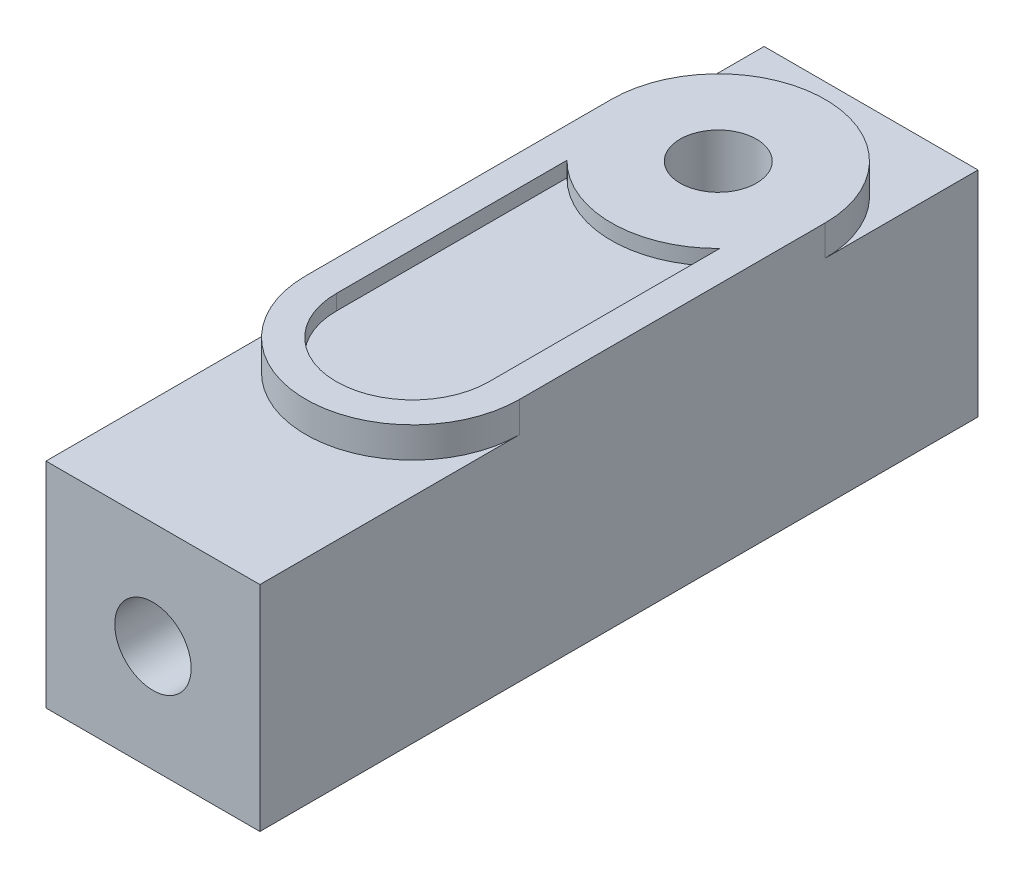
ISO-10303-21;
HEADER;
FILE_DESCRIPTION(('STEP AP214'),'2;1');
FILE_NAME('part.step','',(''),(''),'','','');
FILE_SCHEMA(('AUTOMOTIVE_DESIGN { 1 0 10303 214 1 1 1 1 }'));
ENDSEC;
DATA;
#1=APPLICATION_CONTEXT('core data for automotive mechanical design processes');
#2=APPLICATION_PROTOCOL_DEFINITION('international standard','automotive_design',2000,#1);
#3=PRODUCT_CONTEXT('',#1,'mechanical');
#4=PRODUCT('Part','Part','',(#3));
#5=PRODUCT_RELATED_PRODUCT_CATEGORY('part','',(#4));
#6=PRODUCT_DEFINITION_FORMATION('','',#4);
#7=PRODUCT_DEFINITION_CONTEXT('part definition',#1,'design');
#8=PRODUCT_DEFINITION('design','',#6,#7);
#9=PRODUCT_DEFINITION_SHAPE('','',#8);
#10=(LENGTH_UNIT() NAMED_UNIT(*) SI_UNIT(.MILLI.,.METRE.));
#11=(NAMED_UNIT(*) PLANE_ANGLE_UNIT() SI_UNIT($,.RADIAN.));
#12=(NAMED_UNIT(*) SI_UNIT($,.STERADIAN.) SOLID_ANGLE_UNIT());
#13=UNCERTAINTY_MEASURE_WITH_UNIT(LENGTH_MEASURE(1.E-05),#10,'distance_accuracy_value','');
#14=(GEOMETRIC_REPRESENTATION_CONTEXT(3) GLOBAL_UNCERTAINTY_ASSIGNED_CONTEXT((#13)) GLOBAL_UNIT_ASSIGNED_CONTEXT((#10,
#11,#12)) REPRESENTATION_CONTEXT('',''));
#15=CARTESIAN_POINT('',(0.,0.,0.));
#16=DIRECTION('',(0.,0.,1.));
#17=DIRECTION('',(1.,0.,0.));
#18=AXIS2_PLACEMENT_3D('',#15,#16,#17);
#19=CARTESIAN_POINT('',(0.,7.0000000000001,23.5000000000001));
#20=DIRECTION('',(0.,-1.,0.));
#21=DIRECTION('',(0.,0.,-1.));
#22=AXIS2_PLACEMENT_3D('',#19,#20,#21);
#23=PLANE('',#22);
#24=CARTESIAN_POINT('',(3.5,7.00000000000006,5.00000000000002));
#25=DIRECTION('',(0.,1.,0.));
#26=DIRECTION('',(0.,0.,1.));
#27=AXIS2_PLACEMENT_3D('',#24,#25,#26);
#28=CIRCLE('',#27,3.5);
#29=CARTESIAN_POINT('',(7.00000000000002,7.00000000000004,5.00000000000004));
#30=VERTEX_POINT('',#29);
#31=CARTESIAN_POINT('',(0.,7.00000000000001,5.00000000000003));
#32=VERTEX_POINT('',#31);
#33=EDGE_CURVE('E56',#30,#32,#28,.T.);
#34=ORIENTED_EDGE('',*,*,#33,.F.);
#35=DIRECTION('',(0.,0.,-1.));
#36=VECTOR('',#35,1.);
#37=CARTESIAN_POINT('',(7.00000000000002,7.00000000000007,23.5));
#38=LINE('',#37,#36);
#39=CARTESIAN_POINT('',(7.00000000000006,7.,0.));
#40=VERTEX_POINT('',#39);
#41=EDGE_CURVE('E228',#30,#40,#38,.T.);
#42=ORIENTED_EDGE('',*,*,#41,.T.);
#43=DIRECTION('',(-1.,0.,0.));
#44=VECTOR('',#43,1.);
#45=CARTESIAN_POINT('',(0.,7.,0.));
#46=LINE('',#45,#44);
#47=CARTESIAN_POINT('',(0.,7.,0.));
#48=VERTEX_POINT('',#47);
#49=EDGE_CURVE('E205',#40,#48,#46,.T.);
#50=ORIENTED_EDGE('',*,*,#49,.T.);
#51=DIRECTION('',(0.,0.,-1.));
#52=VECTOR('',#51,1.);
#53=CARTESIAN_POINT('',(0.,7.0000000000001,23.5000000000001));
#54=LINE('',#53,#52);
#55=EDGE_CURVE('E217',#32,#48,#54,.T.);
#56=ORIENTED_EDGE('',*,*,#55,.F.);
#57=EDGE_LOOP('',(#34,#42,#50,#56));
#58=FACE_BOUND('',#57,.T.);
#59=ADVANCED_FACE('F31',(#58),#23,.F.);
#60=CARTESIAN_POINT('',(3.50000000000006,7.00000000000009,15.));
#61=DIRECTION('',(0.,1.,0.));
#62=DIRECTION('',(0.,0.,1.));
#63=AXIS2_PLACEMENT_3D('',#60,#61,#62);
#64=CIRCLE('',#63,3.5);
#65=CARTESIAN_POINT('',(0.,7.00000000000006,15.));
#66=VERTEX_POINT('',#65);
#67=CARTESIAN_POINT('',(7.00000000000006,7.00000000000006,15.));
#68=VERTEX_POINT('',#67);
#69=EDGE_CURVE('E174',#66,#68,#64,.T.);
#70=ORIENTED_EDGE('',*,*,#69,.F.);
#71=CARTESIAN_POINT('',(0.,7.0000000000001,23.5000000000001));
#72=VERTEX_POINT('',#71);
#73=EDGE_CURVE('E226',#72,#66,#54,.T.);
#74=ORIENTED_EDGE('',*,*,#73,.F.);
#75=DIRECTION('',(-1.,0.,0.));
#76=VECTOR('',#75,1.);
#77=CARTESIAN_POINT('',(0.,7.0000000000001,23.5000000000001));
#78=LINE('',#77,#76);
#79=CARTESIAN_POINT('',(7.00000000000002,7.00000000000007,23.5));
#80=VERTEX_POINT('',#79);
#81=EDGE_CURVE('E215',#80,#72,#78,.T.);
#82=ORIENTED_EDGE('',*,*,#81,.F.);
#83=EDGE_CURVE('E230',#80,#68,#38,.T.);
#84=ORIENTED_EDGE('',*,*,#83,.T.);
#85=EDGE_LOOP('',(#70,#74,#82,#84));
#86=FACE_BOUND('',#85,.T.);
#87=ADVANCED_FACE('F267',(#86),#23,.F.);
#88=CARTESIAN_POINT('',(0.,1.04083408558608E-13,23.5));
#89=DIRECTION('',(1.,0.,0.));
#90=DIRECTION('',(0.,0.,-1.));
#91=AXIS2_PLACEMENT_3D('',#88,#89,#90);
#92=PLANE('',#91);
#93=DIRECTION('',(0.,-1.,0.));
#94=VECTOR('',#93,1.);
#95=CARTESIAN_POINT('',(0.,0.,0.));
#96=LINE('',#95,#94);
#97=CARTESIAN_POINT('',(0.,0.,0.));
#98=VERTEX_POINT('',#97);
#99=EDGE_CURVE('E196',#48,#98,#96,.T.);
#100=ORIENTED_EDGE('',*,*,#99,.T.);
#101=DIRECTION('',(0.,0.,-1.));
#102=VECTOR('',#101,1.);
#103=CARTESIAN_POINT('',(0.,1.04083408558608E-13,23.5));
#104=LINE('',#103,#102);
#105=CARTESIAN_POINT('',(0.,1.04083408558608E-13,23.5));
#106=VERTEX_POINT('',#105);
#107=EDGE_CURVE('E11',#106,#98,#104,.T.);
#108=ORIENTED_EDGE('',*,*,#107,.F.);
#109=DIRECTION('',(0.,-1.,0.));
#110=VECTOR('',#109,1.);
#111=CARTESIAN_POINT('',(0.,1.04083408558608E-13,23.5));
#112=LINE('',#111,#110);
#113=EDGE_CURVE('E208',#72,#106,#112,.T.);
#114=ORIENTED_EDGE('',*,*,#113,.F.);
#115=ORIENTED_EDGE('',*,*,#73,.T.);
#116=DIRECTION('',(0.,-1.,0.));
#117=VECTOR('',#116,1.);
#118=CARTESIAN_POINT('',(0.,8.00000000000007,15.));
#119=LINE('',#118,#117);
#120=CARTESIAN_POINT('',(0.,8.00000000000007,15.));
#121=VERTEX_POINT('',#120);
#122=EDGE_CURVE('E185',#121,#66,#119,.T.);
#123=ORIENTED_EDGE('',*,*,#122,.F.);
#124=DIRECTION('',(0.,0.,1.));
#125=VECTOR('',#124,1.);
#126=CARTESIAN_POINT('',(0.,8.,5.00000000000004));
#127=LINE('',#126,#125);
#128=CARTESIAN_POINT('',(0.,8.,5.00000000000004));
#129=VERTEX_POINT('',#128);
#130=EDGE_CURVE('E192',#129,#121,#127,.T.);
#131=ORIENTED_EDGE('',*,*,#130,.F.);
#132=DIRECTION('',(0.,-1.,0.));
#133=VECTOR('',#132,1.);
#134=CARTESIAN_POINT('',(0.,8.,5.00000000000004));
#135=LINE('',#134,#133);
#136=EDGE_CURVE('E200',#129,#32,#135,.T.);
#137=ORIENTED_EDGE('',*,*,#136,.T.);
#138=ORIENTED_EDGE('',*,*,#55,.T.);
#139=EDGE_LOOP('',(#100,#108,#114,#115,#123,#131,#137,#138));
#140=FACE_BOUND('',#139,.T.);
#141=ADVANCED_FACE('F33',(#140),#92,.F.);
#142=CARTESIAN_POINT('',(0.,1.04083408558608E-13,23.5));
#143=DIRECTION('',(0.,1.,0.));
#144=DIRECTION('',(0.,0.,1.));
#145=AXIS2_PLACEMENT_3D('',#142,#143,#144);
#146=PLANE('',#145);
#147=CARTESIAN_POINT('',(3.49999999999994,0.,5.));
#148=DIRECTION('',(0.,1.,0.));
#149=DIRECTION('',(0.,0.,1.));
#150=AXIS2_PLACEMENT_3D('',#147,#148,#149);
#151=CIRCLE('',#150,1.25);
#152=CARTESIAN_POINT('',(3.49999999999993,0.,6.25));
#153=VERTEX_POINT('',#152);
#154=EDGE_CURVE('E165',#153,#153,#151,.T.);
#155=ORIENTED_EDGE('',*,*,#154,.T.);
#156=EDGE_LOOP('',(#155));
#157=FACE_BOUND('',#156,.T.);
#158=DIRECTION('',(1.,0.,0.));
#159=VECTOR('',#158,1.);
#160=CARTESIAN_POINT('',(0.,0.,0.));
#161=LINE('',#160,#159);
#162=CARTESIAN_POINT('',(6.99999999999999,0.,0.));
#163=VERTEX_POINT('',#162);
#164=EDGE_CURVE('E199',#98,#163,#161,.T.);
#165=ORIENTED_EDGE('',*,*,#164,.T.);
#166=DIRECTION('',(0.,0.,-1.));
#167=VECTOR('',#166,1.);
#168=CARTESIAN_POINT('',(6.99999999999994,0.,23.5));
#169=LINE('',#168,#167);
#170=CARTESIAN_POINT('',(6.99999999999994,0.,23.5));
#171=VERTEX_POINT('',#170);
#172=EDGE_CURVE('E40',#171,#163,#169,.T.);
#173=ORIENTED_EDGE('',*,*,#172,.F.);
#174=DIRECTION('',(1.,0.,0.));
#175=VECTOR('',#174,1.);
#176=CARTESIAN_POINT('',(0.,1.04083408558608E-13,23.5));
#177=LINE('',#176,#175);
#178=EDGE_CURVE('E211',#106,#171,#177,.T.);
#179=ORIENTED_EDGE('',*,*,#178,.F.);
#180=ORIENTED_EDGE('',*,*,#107,.T.);
#181=EDGE_LOOP('',(#165,#173,#179,#180));
#182=FACE_BOUND('',#181,.T.);
#183=ADVANCED_FACE('F276',(#157,#182),#146,.F.);
#184=CARTESIAN_POINT('',(6.99999999999994,0.,23.5));
#185=DIRECTION('',(-1.,0.,0.));
#186=DIRECTION('',(0.,0.,1.));
#187=AXIS2_PLACEMENT_3D('',#184,#185,#186);
#188=PLANE('',#187);
#189=DIRECTION('',(0.,1.,0.));
#190=VECTOR('',#189,1.);
#191=CARTESIAN_POINT('',(6.99999999999999,0.,0.));
#192=LINE('',#191,#190);
#193=EDGE_CURVE('E202',#163,#40,#192,.T.);
#194=ORIENTED_EDGE('',*,*,#193,.T.);
#195=ORIENTED_EDGE('',*,*,#41,.F.);
#196=DIRECTION('',(0.,-1.,0.));
#197=VECTOR('',#196,1.);
#198=CARTESIAN_POINT('',(7.00000000000002,8.,5.00000000000006));
#199=LINE('',#198,#197);
#200=CARTESIAN_POINT('',(7.00000000000002,8.,5.00000000000006));
#201=VERTEX_POINT('',#200);
#202=EDGE_CURVE('E177',#201,#30,#199,.T.);
#203=ORIENTED_EDGE('',*,*,#202,.F.);
#204=DIRECTION('',(0.,0.,-1.));
#205=VECTOR('',#204,1.);
#206=CARTESIAN_POINT('',(7.00000000000002,8.,5.00000000000006));
#207=LINE('',#206,#205);
#208=CARTESIAN_POINT('',(7.00000000000006,8.00000000000007,15.));
#209=VERTEX_POINT('',#208);
#210=EDGE_CURVE('E180',#209,#201,#207,.T.);
#211=ORIENTED_EDGE('',*,*,#210,.F.);
#212=DIRECTION('',(0.,-1.,0.));
#213=VECTOR('',#212,1.);
#214=CARTESIAN_POINT('',(7.00000000000006,8.00000000000007,15.));
#215=LINE('',#214,#213);
#216=EDGE_CURVE('E179',#209,#68,#215,.T.);
#217=ORIENTED_EDGE('',*,*,#216,.T.);
#218=ORIENTED_EDGE('',*,*,#83,.F.);
#219=DIRECTION('',(0.,1.,0.));
#220=VECTOR('',#219,1.);
#221=CARTESIAN_POINT('',(6.99999999999994,0.,23.5));
#222=LINE('',#221,#220);
#223=EDGE_CURVE('E213',#171,#80,#222,.T.);
#224=ORIENTED_EDGE('',*,*,#223,.F.);
#225=ORIENTED_EDGE('',*,*,#172,.T.);
#226=EDGE_LOOP('',(#194,#195,#203,#211,#217,#218,#224,#225));
#227=FACE_BOUND('',#226,.T.);
#228=ADVANCED_FACE('F274',(#227),#188,.F.);
#229=CARTESIAN_POINT('',(0.,7.0000000000001,23.5000000000001));
#230=DIRECTION('',(0.,0.,-1.));
#231=DIRECTION('',(-1.,0.,0.));
#232=AXIS2_PLACEMENT_3D('',#229,#230,#231);
#233=PLANE('',#232);
#234=CARTESIAN_POINT('',(3.49999999999994,3.5000000000001,23.5));
#235=DIRECTION('',(0.,0.,1.));
#236=DIRECTION('',(1.,0.,0.));
#237=AXIS2_PLACEMENT_3D('',#234,#235,#236);
#238=CIRCLE('',#237,1.25);
#239=CARTESIAN_POINT('',(4.74999999999994,3.50000000000011,23.5));
#240=VERTEX_POINT('',#239);
#241=EDGE_CURVE('E298',#240,#240,#238,.T.);
#242=ORIENTED_EDGE('',*,*,#241,.F.);
#243=EDGE_LOOP('',(#242));
#244=FACE_BOUND('',#243,.T.);
#245=ORIENTED_EDGE('',*,*,#113,.T.);
#246=ORIENTED_EDGE('',*,*,#178,.T.);
#247=ORIENTED_EDGE('',*,*,#223,.T.);
#248=ORIENTED_EDGE('',*,*,#81,.T.);
#249=EDGE_LOOP('',(#245,#246,#247,#248));
#250=FACE_BOUND('',#249,.T.);
#251=ADVANCED_FACE('F263',(#244,#250),#233,.F.);
#252=CARTESIAN_POINT('',(0.,7.,0.));
#253=DIRECTION('',(0.,0.,-1.));
#254=DIRECTION('',(-1.,0.,0.));
#255=AXIS2_PLACEMENT_3D('',#252,#253,#254);
#256=PLANE('',#255);
#257=ORIENTED_EDGE('',*,*,#99,.F.);
#258=ORIENTED_EDGE('',*,*,#49,.F.);
#259=ORIENTED_EDGE('',*,*,#193,.F.);
#260=ORIENTED_EDGE('',*,*,#164,.F.);
#261=EDGE_LOOP('',(#257,#258,#259,#260));
#262=FACE_BOUND('',#261,.T.);
#263=ADVANCED_FACE('F255',(#262),#256,.T.);
#264=CARTESIAN_POINT('',(3.5,8.00000000000006,5.00000000000004));
#265=DIRECTION('',(0.,-1.,0.));
#266=DIRECTION('',(0.,0.,-1.));
#267=AXIS2_PLACEMENT_3D('',#264,#265,#266);
#268=CYLINDRICAL_SURFACE('',#267,3.5);
#269=ORIENTED_EDGE('',*,*,#33,.T.);
#270=ORIENTED_EDGE('',*,*,#136,.F.);
#271=CARTESIAN_POINT('',(3.5,8.00000000000006,5.00000000000004));
#272=DIRECTION('',(0.,1.,0.));
#273=DIRECTION('',(0.,0.,1.));
#274=AXIS2_PLACEMENT_3D('',#271,#272,#273);
#275=CIRCLE('',#274,3.5);
#276=EDGE_CURVE('E241',#201,#129,#275,.T.);
#277=ORIENTED_EDGE('',*,*,#276,.F.);
#278=ORIENTED_EDGE('',*,*,#202,.T.);
#279=EDGE_LOOP('',(#269,#270,#277,#278));
#280=FACE_BOUND('',#279,.T.);
#281=ADVANCED_FACE('F252',(#280),#268,.T.);
#282=CARTESIAN_POINT('',(3.50000000000006,8.00000000000009,15.));
#283=DIRECTION('',(0.,-1.,0.));
#284=DIRECTION('',(0.,0.,-1.));
#285=AXIS2_PLACEMENT_3D('',#282,#283,#284);
#286=CYLINDRICAL_SURFACE('',#285,3.5);
#287=ORIENTED_EDGE('',*,*,#69,.T.);
#288=ORIENTED_EDGE('',*,*,#216,.F.);
#289=CARTESIAN_POINT('',(3.50000000000006,8.00000000000009,15.));
#290=DIRECTION('',(0.,1.,0.));
#291=DIRECTION('',(0.,0.,1.));
#292=AXIS2_PLACEMENT_3D('',#289,#290,#291);
#293=CIRCLE('',#292,3.5);
#294=EDGE_CURVE('E187',#121,#209,#293,.T.);
#295=ORIENTED_EDGE('',*,*,#294,.F.);
#296=ORIENTED_EDGE('',*,*,#122,.T.);
#297=EDGE_LOOP('',(#287,#288,#295,#296));
#298=FACE_BOUND('',#297,.T.);
#299=ADVANCED_FACE('F254',(#298),#286,.T.);
#300=CARTESIAN_POINT('',(3.5,8.00000000000006,5.00000000000004));
#301=DIRECTION('',(0.,1.,0.));
#302=DIRECTION('',(0.,0.,1.));
#303=AXIS2_PLACEMENT_3D('',#300,#301,#302);
#304=PLANE('',#303);
#305=CARTESIAN_POINT('',(3.5,8.00000000000006,5.00000000000004));
#306=DIRECTION('',(0.,-1.,0.));
#307=DIRECTION('',(0.,0.,1.));
#308=AXIS2_PLACEMENT_3D('',#305,#306,#307);
#309=CIRCLE('',#308,3.5);
#310=CARTESIAN_POINT('',(6.00000000000006,8.,7.44948974278322));
#311=VERTEX_POINT('',#310);
#312=CARTESIAN_POINT('',(0.99999999999997,8.,7.44948974278324));
#313=VERTEX_POINT('',#312);
#314=EDGE_CURVE('E48',#311,#313,#309,.T.);
#315=ORIENTED_EDGE('',*,*,#314,.F.);
#316=DIRECTION('',(0.,0.,-1.));
#317=VECTOR('',#316,1.);
#318=CARTESIAN_POINT('',(6.00000000000006,8.00000000000007,15.0000000000001));
#319=LINE('',#318,#317);
#320=CARTESIAN_POINT('',(6.00000000000006,8.00000000000007,15.0000000000001));
#321=VERTEX_POINT('',#320);
#322=EDGE_CURVE('E144',#321,#311,#319,.T.);
#323=ORIENTED_EDGE('',*,*,#322,.F.);
#324=CARTESIAN_POINT('',(3.50000000000006,8.00000000000009,15.));
#325=DIRECTION('',(0.,1.,0.));
#326=DIRECTION('',(0.,0.,1.));
#327=AXIS2_PLACEMENT_3D('',#324,#325,#326);
#328=CIRCLE('',#327,2.5);
#329=CARTESIAN_POINT('',(0.999999999999966,8.00000000000007,15.0000000000001));
#330=VERTEX_POINT('',#329);
#331=EDGE_CURVE('E126',#330,#321,#328,.T.);
#332=ORIENTED_EDGE('',*,*,#331,.F.);
#333=DIRECTION('',(0.,0.,1.));
#334=VECTOR('',#333,1.);
#335=CARTESIAN_POINT('',(0.999999999999966,8.00000000000007,15.0000000000001));
#336=LINE('',#335,#334);
#337=EDGE_CURVE('E137',#313,#330,#336,.T.);
#338=ORIENTED_EDGE('',*,*,#337,.F.);
#339=EDGE_LOOP('',(#315,#323,#332,#338));
#340=FACE_BOUND('',#339,.T.);
#341=CARTESIAN_POINT('',(3.5,8.00000000000006,5.00000000000004));
#342=DIRECTION('',(0.,1.,0.));
#343=DIRECTION('',(0.,0.,1.));
#344=AXIS2_PLACEMENT_3D('',#341,#342,#343);
#345=CIRCLE('',#344,1.25);
#346=CARTESIAN_POINT('',(3.5,8.00000000000006,6.25000000000004));
#347=VERTEX_POINT('',#346);
#348=EDGE_CURVE('E160',#347,#347,#345,.T.);
#349=ORIENTED_EDGE('',*,*,#348,.F.);
#350=EDGE_LOOP('',(#349));
#351=FACE_BOUND('',#350,.T.);
#352=ORIENTED_EDGE('',*,*,#276,.T.);
#353=ORIENTED_EDGE('',*,*,#130,.T.);
#354=ORIENTED_EDGE('',*,*,#294,.T.);
#355=ORIENTED_EDGE('',*,*,#210,.T.);
#356=EDGE_LOOP('',(#352,#353,#354,#355));
#357=FACE_BOUND('',#356,.T.);
#358=ADVANCED_FACE('F141',(#340,#351,#357),#304,.T.);
#359=CARTESIAN_POINT('',(3.49999999999994,0.,5.));
#360=DIRECTION('',(0.,1.,0.));
#361=DIRECTION('',(0.,0.,1.));
#362=AXIS2_PLACEMENT_3D('',#359,#360,#361);
#363=CYLINDRICAL_SURFACE('',#362,1.25);
#364=ORIENTED_EDGE('',*,*,#154,.F.);
#365=EDGE_LOOP('',(#364));
#366=FACE_BOUND('',#365,.T.);
#367=ORIENTED_EDGE('',*,*,#348,.T.);
#368=EDGE_LOOP('',(#367));
#369=FACE_BOUND('',#368,.T.);
#370=ADVANCED_FACE('F331',(#366,#369),#363,.F.);
#371=CARTESIAN_POINT('',(3.5,7.50000000000006,5.00000000000003));
#372=DIRECTION('',(0.,1.,0.));
#373=DIRECTION('',(0.,0.,1.));
#374=AXIS2_PLACEMENT_3D('',#371,#372,#373);
#375=CYLINDRICAL_SURFACE('',#374,3.5);
#376=ORIENTED_EDGE('',*,*,#314,.T.);
#377=DIRECTION('',(0.,1.,0.));
#378=VECTOR('',#377,1.);
#379=CARTESIAN_POINT('',(0.99999999999997,7.50000000000003,7.44948974278323));
#380=LINE('',#379,#378);
#381=CARTESIAN_POINT('',(0.99999999999997,7.50000000000003,7.44948974278323));
#382=VERTEX_POINT('',#381);
#383=EDGE_CURVE('E134',#382,#313,#380,.T.);
#384=ORIENTED_EDGE('',*,*,#383,.F.);
#385=CARTESIAN_POINT('',(3.5,7.50000000000006,5.00000000000003));
#386=DIRECTION('',(0.,-1.,0.));
#387=DIRECTION('',(0.,0.,1.));
#388=AXIS2_PLACEMENT_3D('',#385,#386,#387);
#389=CIRCLE('',#388,3.5);
#390=CARTESIAN_POINT('',(6.00000000000006,7.50000000000004,7.44948974278322));
#391=VERTEX_POINT('',#390);
#392=EDGE_CURVE('E146',#391,#382,#389,.T.);
#393=ORIENTED_EDGE('',*,*,#392,.F.);
#394=DIRECTION('',(0.,1.,0.));
#395=VECTOR('',#394,1.);
#396=CARTESIAN_POINT('',(6.00000000000006,7.50000000000004,7.44948974278322));
#397=LINE('',#396,#395);
#398=EDGE_CURVE('E158',#391,#311,#397,.T.);
#399=ORIENTED_EDGE('',*,*,#398,.T.);
#400=EDGE_LOOP('',(#376,#384,#393,#399));
#401=FACE_BOUND('',#400,.T.);
#402=ADVANCED_FACE('F323',(#401),#375,.T.);
#403=CARTESIAN_POINT('',(6.00000000000006,7.50000000000006,15.));
#404=DIRECTION('',(1.,0.,0.));
#405=DIRECTION('',(0.,0.,-1.));
#406=AXIS2_PLACEMENT_3D('',#403,#404,#405);
#407=PLANE('',#406);
#408=ORIENTED_EDGE('',*,*,#322,.T.);
#409=ORIENTED_EDGE('',*,*,#398,.F.);
#410=DIRECTION('',(0.,0.,-1.));
#411=VECTOR('',#410,1.);
#412=CARTESIAN_POINT('',(6.00000000000006,7.50000000000006,15.));
#413=LINE('',#412,#411);
#414=CARTESIAN_POINT('',(6.00000000000006,7.50000000000006,15.));
#415=VERTEX_POINT('',#414);
#416=EDGE_CURVE('E155',#415,#391,#413,.T.);
#417=ORIENTED_EDGE('',*,*,#416,.F.);
#418=DIRECTION('',(0.,1.,0.));
#419=VECTOR('',#418,1.);
#420=CARTESIAN_POINT('',(6.00000000000006,7.50000000000006,15.));
#421=LINE('',#420,#419);
#422=EDGE_CURVE('E133',#415,#321,#421,.T.);
#423=ORIENTED_EDGE('',*,*,#422,.T.);
#424=EDGE_LOOP('',(#408,#409,#417,#423));
#425=FACE_BOUND('',#424,.T.);
#426=ADVANCED_FACE('F320',(#425),#407,.F.);
#427=CARTESIAN_POINT('',(3.50000000000006,7.50000000000009,15.));
#428=DIRECTION('',(0.,1.,0.));
#429=DIRECTION('',(0.,0.,1.));
#430=AXIS2_PLACEMENT_3D('',#427,#428,#429);
#431=CYLINDRICAL_SURFACE('',#430,2.5);
#432=ORIENTED_EDGE('',*,*,#331,.T.);
#433=ORIENTED_EDGE('',*,*,#422,.F.);
#434=CARTESIAN_POINT('',(3.50000000000006,7.50000000000009,15.));
#435=DIRECTION('',(0.,1.,0.));
#436=DIRECTION('',(0.,0.,1.));
#437=AXIS2_PLACEMENT_3D('',#434,#435,#436);
#438=CIRCLE('',#437,2.5);
#439=CARTESIAN_POINT('',(0.99999999999997,7.50000000000006,15.0000000000001));
#440=VERTEX_POINT('',#439);
#441=EDGE_CURVE('E129',#440,#415,#438,.T.);
#442=ORIENTED_EDGE('',*,*,#441,.F.);
#443=DIRECTION('',(0.,1.,0.));
#444=VECTOR('',#443,1.);
#445=CARTESIAN_POINT('',(0.99999999999997,7.50000000000006,15.0000000000001));
#446=LINE('',#445,#444);
#447=EDGE_CURVE('E122',#440,#330,#446,.T.);
#448=ORIENTED_EDGE('',*,*,#447,.T.);
#449=EDGE_LOOP('',(#432,#433,#442,#448));
#450=FACE_BOUND('',#449,.T.);
#451=ADVANCED_FACE('F124',(#450),#431,.F.);
#452=CARTESIAN_POINT('',(0.99999999999997,7.50000000000006,15.0000000000001));
#453=DIRECTION('',(-1.,0.,0.));
#454=DIRECTION('',(0.,0.,1.));
#455=AXIS2_PLACEMENT_3D('',#452,#453,#454);
#456=PLANE('',#455);
#457=ORIENTED_EDGE('',*,*,#337,.T.);
#458=ORIENTED_EDGE('',*,*,#447,.F.);
#459=DIRECTION('',(0.,0.,1.));
#460=VECTOR('',#459,1.);
#461=CARTESIAN_POINT('',(0.99999999999997,7.50000000000006,15.0000000000001));
#462=LINE('',#461,#460);
#463=EDGE_CURVE('E152',#382,#440,#462,.T.);
#464=ORIENTED_EDGE('',*,*,#463,.F.);
#465=ORIENTED_EDGE('',*,*,#383,.T.);
#466=EDGE_LOOP('',(#457,#458,#464,#465));
#467=FACE_BOUND('',#466,.T.);
#468=ADVANCED_FACE('F138',(#467),#456,.F.);
#469=CARTESIAN_POINT('',(3.5,7.50000000000006,5.00000000000003));
#470=DIRECTION('',(0.,1.,0.));
#471=DIRECTION('',(0.,0.,1.));
#472=AXIS2_PLACEMENT_3D('',#469,#470,#471);
#473=PLANE('',#472);
#474=ORIENTED_EDGE('',*,*,#392,.T.);
#475=ORIENTED_EDGE('',*,*,#463,.T.);
#476=ORIENTED_EDGE('',*,*,#441,.T.);
#477=ORIENTED_EDGE('',*,*,#416,.T.);
#478=EDGE_LOOP('',(#474,#475,#476,#477));
#479=FACE_BOUND('',#478,.T.);
#480=ADVANCED_FACE('F310',(#479),#473,.T.);
#481=CARTESIAN_POINT('',(3.5,3.50000000000007,13.5));
#482=DIRECTION('',(0.,0.,1.));
#483=DIRECTION('',(1.,0.,0.));
#484=AXIS2_PLACEMENT_3D('',#481,#482,#483);
#485=CYLINDRICAL_SURFACE('',#484,1.25);
#486=CARTESIAN_POINT('',(3.5,3.50000000000007,13.5));
#487=DIRECTION('',(0.,0.,1.));
#488=DIRECTION('',(1.,0.,0.));
#489=AXIS2_PLACEMENT_3D('',#486,#487,#488);
#490=CIRCLE('',#489,1.25);
#491=CARTESIAN_POINT('',(4.75,3.50000000000007,13.5));
#492=VERTEX_POINT('',#491);
#493=EDGE_CURVE('E300',#492,#492,#490,.T.);
#494=ORIENTED_EDGE('',*,*,#493,.F.);
#495=EDGE_LOOP('',(#494));
#496=FACE_BOUND('',#495,.T.);
#497=ORIENTED_EDGE('',*,*,#241,.T.);
#498=EDGE_LOOP('',(#497));
#499=FACE_BOUND('',#498,.T.);
#500=ADVANCED_FACE('F308',(#496,#499),#485,.F.);
#501=CARTESIAN_POINT('',(3.5,3.50000000000007,13.5));
#502=DIRECTION('',(0.,0.,1.));
#503=DIRECTION('',(1.,0.,0.));
#504=AXIS2_PLACEMENT_3D('',#501,#502,#503);
#505=PLANE('',#504);
#506=ORIENTED_EDGE('',*,*,#493,.T.);
#507=EDGE_LOOP('',(#506));
#508=FACE_BOUND('',#507,.T.);
#509=ADVANCED_FACE('F306',(#508),#505,.T.);
#510=CLOSED_SHELL('',(#59,#87,#141,#183,#228,#251,#263,#281,#299,#358,#370,#402,#426,#451,#468,
#480,#500,#509));
#511=MANIFOLD_SOLID_BREP('B2',#510);
#512=ADVANCED_BREP_SHAPE_REPRESENTATION('',(#18,#511),#14);
#513=SHAPE_DEFINITION_REPRESENTATION(#9,#512);
ENDSEC;
END-ISO-10303-21;
